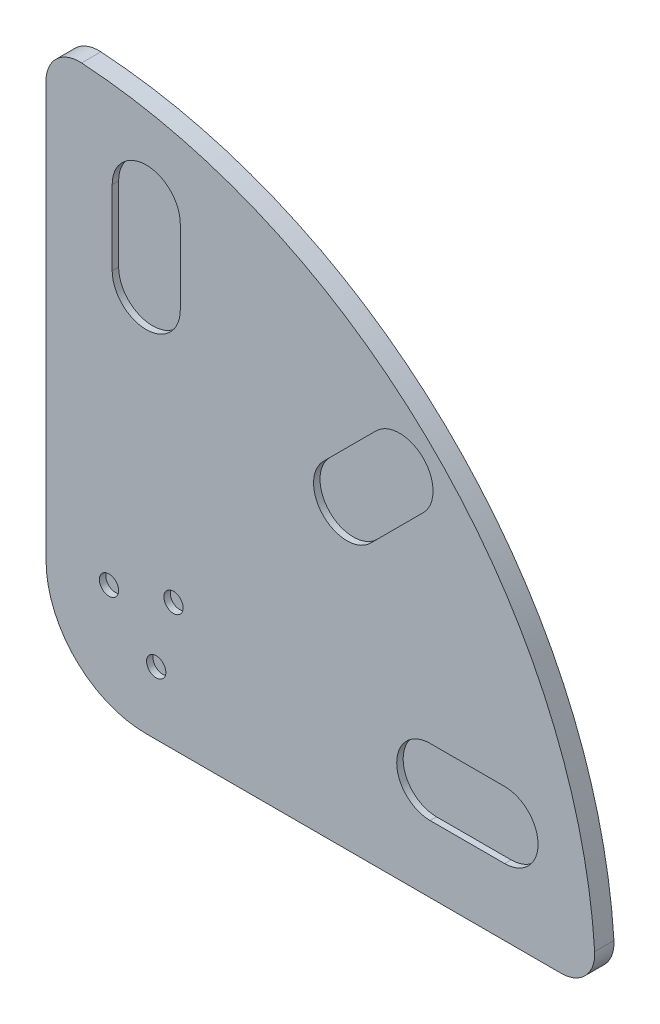
ISO-10303-21;
HEADER;
FILE_DESCRIPTION(('STEP AP214'),'2;1');
FILE_NAME('part.step','',(''),(''),'','','');
FILE_SCHEMA(('AUTOMOTIVE_DESIGN { 1 0 10303 214 1 1 1 1 }'));
ENDSEC;
DATA;
#1=APPLICATION_CONTEXT('core data for automotive mechanical design processes');
#2=APPLICATION_PROTOCOL_DEFINITION('international standard','automotive_design',2000,#1);
#3=PRODUCT_CONTEXT('',#1,'mechanical');
#4=PRODUCT('Part','Part','',(#3));
#5=PRODUCT_RELATED_PRODUCT_CATEGORY('part','',(#4));
#6=PRODUCT_DEFINITION_FORMATION('','',#4);
#7=PRODUCT_DEFINITION_CONTEXT('part definition',#1,'design');
#8=PRODUCT_DEFINITION('design','',#6,#7);
#9=PRODUCT_DEFINITION_SHAPE('','',#8);
#10=(LENGTH_UNIT() NAMED_UNIT(*) SI_UNIT(.MILLI.,.METRE.));
#11=(NAMED_UNIT(*) PLANE_ANGLE_UNIT() SI_UNIT($,.RADIAN.));
#12=(NAMED_UNIT(*) SI_UNIT($,.STERADIAN.) SOLID_ANGLE_UNIT());
#13=UNCERTAINTY_MEASURE_WITH_UNIT(LENGTH_MEASURE(1.E-05),#10,'distance_accuracy_value','');
#14=(GEOMETRIC_REPRESENTATION_CONTEXT(3) GLOBAL_UNCERTAINTY_ASSIGNED_CONTEXT((#13)) GLOBAL_UNIT_ASSIGNED_CONTEXT((#10,
#11,#12)) REPRESENTATION_CONTEXT('',''));
#15=CARTESIAN_POINT('',(0.,0.,0.));
#16=DIRECTION('',(0.,0.,1.));
#17=DIRECTION('',(1.,0.,0.));
#18=AXIS2_PLACEMENT_3D('',#15,#16,#17);
#19=CARTESIAN_POINT('',(0.,0.,15.));
#20=DIRECTION('',(0.,0.,-1.));
#21=DIRECTION('',(-1.,0.,0.));
#22=AXIS2_PLACEMENT_3D('',#19,#20,#21);
#23=CYLINDRICAL_SURFACE('',#22,78.);
#24=CARTESIAN_POINT('',(0.,0.,0.));
#25=DIRECTION('',(0.,0.,1.));
#26=DIRECTION('',(1.,0.,0.));
#27=AXIS2_PLACEMENT_3D('',#24,#25,#26);
#28=CIRCLE('',#27,78.);
#29=CARTESIAN_POINT('',(-78.,0.,0.));
#30=VERTEX_POINT('',#29);
#31=CARTESIAN_POINT('',(0.,-78.,0.));
#32=VERTEX_POINT('',#31);
#33=EDGE_CURVE('E283',#30,#32,#28,.T.);
#34=ORIENTED_EDGE('',*,*,#33,.T.);
#35=DIRECTION('',(0.,0.,-1.));
#36=VECTOR('',#35,1.);
#37=CARTESIAN_POINT('',(0.,-78.,15.));
#38=LINE('',#37,#36);
#39=CARTESIAN_POINT('',(0.,-78.,15.));
#40=VERTEX_POINT('',#39);
#41=EDGE_CURVE('E307',#40,#32,#38,.T.);
#42=ORIENTED_EDGE('',*,*,#41,.F.);
#43=CARTESIAN_POINT('',(0.,0.,15.));
#44=DIRECTION('',(0.,0.,1.));
#45=DIRECTION('',(1.,0.,0.));
#46=AXIS2_PLACEMENT_3D('',#43,#44,#45);
#47=CIRCLE('',#46,78.);
#48=CARTESIAN_POINT('',(-78.,0.,15.));
#49=VERTEX_POINT('',#48);
#50=EDGE_CURVE('E286',#49,#40,#47,.T.);
#51=ORIENTED_EDGE('',*,*,#50,.F.);
#52=DIRECTION('',(0.,0.,-1.));
#53=VECTOR('',#52,1.);
#54=CARTESIAN_POINT('',(-78.,0.,15.));
#55=LINE('',#54,#53);
#56=EDGE_CURVE('E296',#49,#30,#55,.T.);
#57=ORIENTED_EDGE('',*,*,#56,.T.);
#58=EDGE_LOOP('',(#34,#42,#51,#57));
#59=FACE_BOUND('',#58,.T.);
#60=ADVANCED_FACE('F34',(#59),#23,.T.);
#61=CARTESIAN_POINT('',(0.,-78.,15.));
#62=DIRECTION('',(0.,1.,0.));
#63=DIRECTION('',(0.,0.,1.));
#64=AXIS2_PLACEMENT_3D('',#61,#62,#63);
#65=PLANE('',#64);
#66=DIRECTION('',(1.,0.,0.));
#67=VECTOR('',#66,1.);
#68=CARTESIAN_POINT('',(0.,-78.,0.));
#69=LINE('',#68,#67);
#70=CARTESIAN_POINT('',(323.158322860189,-78.,0.));
#71=VERTEX_POINT('',#70);
#72=EDGE_CURVE('E299',#32,#71,#69,.T.);
#73=ORIENTED_EDGE('',*,*,#72,.T.);
#74=DIRECTION('',(0.,0.,-1.));
#75=VECTOR('',#74,1.);
#76=CARTESIAN_POINT('',(323.158322860189,-78.,15.));
#77=LINE('',#76,#75);
#78=CARTESIAN_POINT('',(323.158322860189,-78.,15.));
#79=VERTEX_POINT('',#78);
#80=EDGE_CURVE('E57',#71,#79,#77,.F.);
#81=ORIENTED_EDGE('',*,*,#80,.T.);
#82=DIRECTION('',(1.,0.,0.));
#83=VECTOR('',#82,1.);
#84=CARTESIAN_POINT('',(0.,-78.,15.));
#85=LINE('',#84,#83);
#86=EDGE_CURVE('E289',#40,#79,#85,.T.);
#87=ORIENTED_EDGE('',*,*,#86,.F.);
#88=ORIENTED_EDGE('',*,*,#41,.T.);
#89=EDGE_LOOP('',(#73,#81,#87,#88));
#90=FACE_BOUND('',#89,.T.);
#91=ADVANCED_FACE('F333',(#90),#65,.F.);
#92=CARTESIAN_POINT('',(-78.,-78.,15.));
#93=DIRECTION('',(0.,0.,-1.));
#94=DIRECTION('',(-1.,0.,0.));
#95=AXIS2_PLACEMENT_3D('',#92,#93,#94);
#96=CYLINDRICAL_SURFACE('',#95,428.);
#97=CARTESIAN_POINT('',(-78.,-78.,15.));
#98=DIRECTION('',(0.,0.,1.));
#99=DIRECTION('',(-1.,0.,0.));
#100=AXIS2_PLACEMENT_3D('',#97,#98,#99);
#101=CIRCLE('',#100,428.);
#102=CARTESIAN_POINT('',(349.103886030251,-50.318407960199,15.));
#103=VERTEX_POINT('',#102);
#104=CARTESIAN_POINT('',(-50.318407960199,349.103886030251,15.));
#105=VERTEX_POINT('',#104);
#106=EDGE_CURVE('E292',#103,#105,#101,.T.);
#107=ORIENTED_EDGE('',*,*,#106,.F.);
#108=DIRECTION('',(0.,0.,-1.));
#109=VECTOR('',#108,1.);
#110=CARTESIAN_POINT('',(349.103886030251,-50.318407960199,15.));
#111=LINE('',#110,#109);
#112=CARTESIAN_POINT('',(349.103886030251,-50.318407960199,0.));
#113=VERTEX_POINT('',#112);
#114=EDGE_CURVE('E312',#103,#113,#111,.T.);
#115=ORIENTED_EDGE('',*,*,#114,.T.);
#116=CARTESIAN_POINT('',(-78.,-78.,0.));
#117=DIRECTION('',(0.,0.,1.));
#118=DIRECTION('',(-1.,0.,0.));
#119=AXIS2_PLACEMENT_3D('',#116,#117,#118);
#120=CIRCLE('',#119,428.);
#121=CARTESIAN_POINT('',(-50.318407960199,349.103886030251,0.));
#122=VERTEX_POINT('',#121);
#123=EDGE_CURVE('E301',#113,#122,#120,.T.);
#124=ORIENTED_EDGE('',*,*,#123,.T.);
#125=DIRECTION('',(0.,0.,-1.));
#126=VECTOR('',#125,1.);
#127=CARTESIAN_POINT('',(-50.318407960199,349.103886030251,15.));
#128=LINE('',#127,#126);
#129=EDGE_CURVE('E310',#122,#105,#128,.F.);
#130=ORIENTED_EDGE('',*,*,#129,.T.);
#131=EDGE_LOOP('',(#107,#115,#124,#130));
#132=FACE_BOUND('',#131,.T.);
#133=ADVANCED_FACE('F326',(#132),#96,.T.);
#134=CARTESIAN_POINT('',(-78.,0.,15.));
#135=DIRECTION('',(1.,0.,0.));
#136=DIRECTION('',(0.,0.,-1.));
#137=AXIS2_PLACEMENT_3D('',#134,#135,#136);
#138=PLANE('',#137);
#139=DIRECTION('',(0.,-1.,0.));
#140=VECTOR('',#139,1.);
#141=CARTESIAN_POINT('',(-78.,0.,15.));
#142=LINE('',#141,#140);
#143=CARTESIAN_POINT('',(-78.,323.158322860189,15.));
#144=VERTEX_POINT('',#143);
#145=EDGE_CURVE('E294',#144,#49,#142,.T.);
#146=ORIENTED_EDGE('',*,*,#145,.F.);
#147=DIRECTION('',(0.,0.,-1.));
#148=VECTOR('',#147,1.);
#149=CARTESIAN_POINT('',(-78.,323.158322860189,15.));
#150=LINE('',#149,#148);
#151=CARTESIAN_POINT('',(-78.,323.158322860189,0.));
#152=VERTEX_POINT('',#151);
#153=EDGE_CURVE('E11',#144,#152,#150,.T.);
#154=ORIENTED_EDGE('',*,*,#153,.T.);
#155=DIRECTION('',(0.,-1.,0.));
#156=VECTOR('',#155,1.);
#157=CARTESIAN_POINT('',(-78.,0.,0.));
#158=LINE('',#157,#156);
#159=EDGE_CURVE('E290',#152,#30,#158,.T.);
#160=ORIENTED_EDGE('',*,*,#159,.T.);
#161=ORIENTED_EDGE('',*,*,#56,.F.);
#162=EDGE_LOOP('',(#146,#154,#160,#161));
#163=FACE_BOUND('',#162,.T.);
#164=ADVANCED_FACE('F340',(#163),#138,.F.);
#165=CARTESIAN_POINT('',(0.,0.,15.));
#166=DIRECTION('',(0.,0.,1.));
#167=DIRECTION('',(1.,0.,0.));
#168=AXIS2_PLACEMENT_3D('',#165,#166,#167);
#169=PLANE('',#168);
#170=CARTESIAN_POINT('',(7.76457135307558,-28.9777747886721,15.));
#171=DIRECTION('',(0.,0.,1.));
#172=DIRECTION('',(1.,0.,0.));
#173=AXIS2_PLACEMENT_3D('',#170,#171,#172);
#174=CIRCLE('',#173,7.49999999999999);
#175=CARTESIAN_POINT('',(15.2645713530756,-28.9777747886721,15.));
#176=VERTEX_POINT('',#175);
#177=EDGE_CURVE('E208',#176,#176,#174,.T.);
#178=ORIENTED_EDGE('',*,*,#177,.F.);
#179=EDGE_LOOP('',(#178));
#180=FACE_BOUND('',#179,.T.);
#181=CARTESIAN_POINT('',(-28.977774788672,7.76457135307565,15.));
#182=DIRECTION('',(0.,0.,1.));
#183=DIRECTION('',(1.,0.,0.));
#184=AXIS2_PLACEMENT_3D('',#181,#182,#183);
#185=CIRCLE('',#184,7.5);
#186=CARTESIAN_POINT('',(-21.477774788672,7.76457135307565,15.));
#187=VERTEX_POINT('',#186);
#188=EDGE_CURVE('E214',#187,#187,#185,.T.);
#189=ORIENTED_EDGE('',*,*,#188,.F.);
#190=EDGE_LOOP('',(#189));
#191=FACE_BOUND('',#190,.T.);
#192=CARTESIAN_POINT('',(0.,279.,15.));
#193=DIRECTION('',(0.,0.,1.));
#194=DIRECTION('',(1.,0.,0.));
#195=AXIS2_PLACEMENT_3D('',#192,#193,#194);
#196=CIRCLE('',#195,26.5);
#197=CARTESIAN_POINT('',(26.5,279.,15.));
#198=VERTEX_POINT('',#197);
#199=CARTESIAN_POINT('',(-26.5,279.,15.));
#200=VERTEX_POINT('',#199);
#201=EDGE_CURVE('E232',#198,#200,#196,.T.);
#202=ORIENTED_EDGE('',*,*,#201,.F.);
#203=DIRECTION('',(0.,1.,0.));
#204=VECTOR('',#203,1.);
#205=CARTESIAN_POINT('',(26.5,279.,15.));
#206=LINE('',#205,#204);
#207=CARTESIAN_POINT('',(26.5,221.,15.));
#208=VERTEX_POINT('',#207);
#209=EDGE_CURVE('E222',#208,#198,#206,.T.);
#210=ORIENTED_EDGE('',*,*,#209,.F.);
#211=CARTESIAN_POINT('',(0.,221.,15.));
#212=DIRECTION('',(0.,0.,1.));
#213=DIRECTION('',(1.,0.,0.));
#214=AXIS2_PLACEMENT_3D('',#211,#212,#213);
#215=CIRCLE('',#214,26.5);
#216=CARTESIAN_POINT('',(-26.5,221.,15.));
#217=VERTEX_POINT('',#216);
#218=EDGE_CURVE('E238',#217,#208,#215,.T.);
#219=ORIENTED_EDGE('',*,*,#218,.F.);
#220=DIRECTION('',(0.,-1.,0.));
#221=VECTOR('',#220,1.);
#222=CARTESIAN_POINT('',(-26.5,279.,15.));
#223=LINE('',#222,#221);
#224=EDGE_CURVE('E234',#200,#217,#223,.T.);
#225=ORIENTED_EDGE('',*,*,#224,.F.);
#226=EDGE_LOOP('',(#202,#210,#219,#225));
#227=FACE_BOUND('',#226,.T.);
#228=CARTESIAN_POINT('',(197.282791951047,197.282791951046,15.));
#229=DIRECTION('',(0.,0.,1.));
#230=DIRECTION('',(1.,0.,0.));
#231=AXIS2_PLACEMENT_3D('',#228,#229,#230);
#232=CIRCLE('',#231,26.);
#233=CARTESIAN_POINT('',(215.667568261897,178.898015640196,15.));
#234=VERTEX_POINT('',#233);
#235=CARTESIAN_POINT('',(178.898015640197,215.667568261897,15.));
#236=VERTEX_POINT('',#235);
#237=EDGE_CURVE('E200',#234,#236,#232,.T.);
#238=ORIENTED_EDGE('',*,*,#237,.F.);
#239=DIRECTION('',(0.707106781186547,0.707106781186548,0.));
#240=VECTOR('',#239,1.);
#241=CARTESIAN_POINT('',(215.667568261897,178.898015640196,15.));
#242=LINE('',#241,#240);
#243=CARTESIAN_POINT('',(174.655374953078,137.885822331376,15.));
#244=VERTEX_POINT('',#243);
#245=EDGE_CURVE('E254',#244,#234,#242,.T.);
#246=ORIENTED_EDGE('',*,*,#245,.F.);
#247=CARTESIAN_POINT('',(156.270598642227,156.270598642227,15.));
#248=DIRECTION('',(0.,0.,1.));
#249=DIRECTION('',(1.,0.,0.));
#250=AXIS2_PLACEMENT_3D('',#247,#248,#249);
#251=CIRCLE('',#250,26.0000000000001);
#252=CARTESIAN_POINT('',(137.885822331377,174.655374953077,15.));
#253=VERTEX_POINT('',#252);
#254=EDGE_CURVE('E268',#253,#244,#251,.T.);
#255=ORIENTED_EDGE('',*,*,#254,.F.);
#256=DIRECTION('',(-0.707106781186548,-0.707106781186547,0.));
#257=VECTOR('',#256,1.);
#258=CARTESIAN_POINT('',(178.898015640197,215.667568261897,15.));
#259=LINE('',#258,#257);
#260=EDGE_CURVE('E265',#236,#253,#259,.T.);
#261=ORIENTED_EDGE('',*,*,#260,.F.);
#262=EDGE_LOOP('',(#238,#246,#255,#261));
#263=FACE_BOUND('',#262,.T.);
#264=CARTESIAN_POINT('',(221.,0.,15.));
#265=DIRECTION('',(0.,0.,1.));
#266=DIRECTION('',(1.,0.,0.));
#267=AXIS2_PLACEMENT_3D('',#264,#265,#266);
#268=CIRCLE('',#267,26.);
#269=CARTESIAN_POINT('',(221.,26.,15.));
#270=VERTEX_POINT('',#269);
#271=CARTESIAN_POINT('',(221.,-26.,15.));
#272=VERTEX_POINT('',#271);
#273=EDGE_CURVE('E168',#270,#272,#268,.T.);
#274=ORIENTED_EDGE('',*,*,#273,.F.);
#275=DIRECTION('',(-1.,0.,0.));
#276=VECTOR('',#275,1.);
#277=CARTESIAN_POINT('',(221.,26.,15.));
#278=LINE('',#277,#276);
#279=CARTESIAN_POINT('',(279.,26.,15.));
#280=VERTEX_POINT('',#279);
#281=EDGE_CURVE('E185',#280,#270,#278,.T.);
#282=ORIENTED_EDGE('',*,*,#281,.F.);
#283=CARTESIAN_POINT('',(279.,0.,15.));
#284=DIRECTION('',(0.,0.,1.));
#285=DIRECTION('',(1.,0.,0.));
#286=AXIS2_PLACEMENT_3D('',#283,#284,#285);
#287=CIRCLE('',#286,26.);
#288=CARTESIAN_POINT('',(279.,-26.,15.));
#289=VERTEX_POINT('',#288);
#290=EDGE_CURVE('E188',#289,#280,#287,.T.);
#291=ORIENTED_EDGE('',*,*,#290,.F.);
#292=DIRECTION('',(1.,0.,0.));
#293=VECTOR('',#292,1.);
#294=CARTESIAN_POINT('',(221.,-26.,15.));
#295=LINE('',#294,#293);
#296=EDGE_CURVE('E194',#272,#289,#295,.T.);
#297=ORIENTED_EDGE('',*,*,#296,.F.);
#298=EDGE_LOOP('',(#274,#282,#291,#297));
#299=FACE_BOUND('',#298,.T.);
#300=CARTESIAN_POINT('',(21.2132034355965,21.2132034355964,15.));
#301=DIRECTION('',(0.,0.,1.));
#302=DIRECTION('',(1.,0.,0.));
#303=AXIS2_PLACEMENT_3D('',#300,#301,#302);
#304=CIRCLE('',#303,7.49999999999998);
#305=CARTESIAN_POINT('',(28.7132034355964,21.2132034355964,15.));
#306=VERTEX_POINT('',#305);
#307=EDGE_CURVE('E207',#306,#306,#304,.T.);
#308=ORIENTED_EDGE('',*,*,#307,.F.);
#309=EDGE_LOOP('',(#308));
#310=FACE_BOUND('',#309,.T.);
#311=ORIENTED_EDGE('',*,*,#86,.T.);
#312=CARTESIAN_POINT('',(323.158322860189,-52.,15.));
#313=DIRECTION('',(0.,0.,1.));
#314=DIRECTION('',(1.,0.,0.));
#315=AXIS2_PLACEMENT_3D('',#312,#313,#314);
#316=CIRCLE('',#315,26.);
#317=EDGE_CURVE('E42',#79,#103,#316,.T.);
#318=ORIENTED_EDGE('',*,*,#317,.T.);
#319=ORIENTED_EDGE('',*,*,#106,.T.);
#320=CARTESIAN_POINT('',(-52.,323.158322860189,15.));
#321=DIRECTION('',(0.,0.,1.));
#322=DIRECTION('',(1.,0.,0.));
#323=AXIS2_PLACEMENT_3D('',#320,#321,#322);
#324=CIRCLE('',#323,26.);
#325=EDGE_CURVE('E49',#105,#144,#324,.T.);
#326=ORIENTED_EDGE('',*,*,#325,.T.);
#327=ORIENTED_EDGE('',*,*,#145,.T.);
#328=ORIENTED_EDGE('',*,*,#50,.T.);
#329=EDGE_LOOP('',(#311,#318,#319,#326,#327,#328));
#330=FACE_BOUND('',#329,.T.);
#331=ADVANCED_FACE('F322',(#180,#191,#227,#263,#299,#310,#330),#169,.T.);
#332=CARTESIAN_POINT('',(0.,0.,0.));
#333=DIRECTION('',(0.,0.,1.));
#334=DIRECTION('',(1.,0.,0.));
#335=AXIS2_PLACEMENT_3D('',#332,#333,#334);
#336=PLANE('',#335);
#337=ORIENTED_EDGE('',*,*,#123,.F.);
#338=CARTESIAN_POINT('',(323.158322860189,-52.,0.));
#339=DIRECTION('',(0.,0.,1.));
#340=DIRECTION('',(1.,0.,0.));
#341=AXIS2_PLACEMENT_3D('',#338,#339,#340);
#342=CIRCLE('',#341,26.);
#343=EDGE_CURVE('E317',#113,#71,#342,.F.);
#344=ORIENTED_EDGE('',*,*,#343,.T.);
#345=ORIENTED_EDGE('',*,*,#72,.F.);
#346=ORIENTED_EDGE('',*,*,#33,.F.);
#347=ORIENTED_EDGE('',*,*,#159,.F.);
#348=CARTESIAN_POINT('',(-52.,323.158322860189,0.));
#349=DIRECTION('',(0.,0.,1.));
#350=DIRECTION('',(1.,0.,0.));
#351=AXIS2_PLACEMENT_3D('',#348,#349,#350);
#352=CIRCLE('',#351,26.);
#353=EDGE_CURVE('E315',#152,#122,#352,.F.);
#354=ORIENTED_EDGE('',*,*,#353,.T.);
#355=EDGE_LOOP('',(#337,#344,#345,#346,#347,#354));
#356=FACE_BOUND('',#355,.T.);
#357=ADVANCED_FACE('F331',(#356),#336,.F.);
#358=CARTESIAN_POINT('',(21.2132034355965,21.2132034355964,10.));
#359=DIRECTION('',(0.,0.,1.));
#360=DIRECTION('',(1.,0.,0.));
#361=AXIS2_PLACEMENT_3D('',#358,#359,#360);
#362=CYLINDRICAL_SURFACE('',#361,7.49999999999998);
#363=CARTESIAN_POINT('',(21.2132034355965,21.2132034355964,10.));
#364=DIRECTION('',(0.,0.,1.));
#365=DIRECTION('',(1.,0.,0.));
#366=AXIS2_PLACEMENT_3D('',#363,#364,#365);
#367=CIRCLE('',#366,7.49999999999998);
#368=CARTESIAN_POINT('',(28.7132034355964,21.2132034355964,10.));
#369=VERTEX_POINT('',#368);
#370=EDGE_CURVE('E280',#369,#369,#367,.T.);
#371=ORIENTED_EDGE('',*,*,#370,.F.);
#372=EDGE_LOOP('',(#371));
#373=FACE_BOUND('',#372,.T.);
#374=ORIENTED_EDGE('',*,*,#307,.T.);
#375=EDGE_LOOP('',(#374));
#376=FACE_BOUND('',#375,.T.);
#377=ADVANCED_FACE('F361',(#373,#376),#362,.F.);
#378=CARTESIAN_POINT('',(21.2132034355965,21.2132034355964,10.));
#379=DIRECTION('',(0.,0.,1.));
#380=DIRECTION('',(1.,0.,0.));
#381=AXIS2_PLACEMENT_3D('',#378,#379,#380);
#382=PLANE('',#381);
#383=ORIENTED_EDGE('',*,*,#370,.T.);
#384=EDGE_LOOP('',(#383));
#385=FACE_BOUND('',#384,.T.);
#386=ADVANCED_FACE('F367',(#385),#382,.T.);
#387=CARTESIAN_POINT('',(221.,0.,10.));
#388=DIRECTION('',(0.,0.,1.));
#389=DIRECTION('',(1.,0.,0.));
#390=AXIS2_PLACEMENT_3D('',#387,#388,#389);
#391=CYLINDRICAL_SURFACE('',#390,26.);
#392=ORIENTED_EDGE('',*,*,#273,.T.);
#393=DIRECTION('',(0.,0.,1.));
#394=VECTOR('',#393,1.);
#395=CARTESIAN_POINT('',(221.,-26.,10.));
#396=LINE('',#395,#394);
#397=CARTESIAN_POINT('',(221.,-26.,10.));
#398=VERTEX_POINT('',#397);
#399=EDGE_CURVE('E161',#398,#272,#396,.T.);
#400=ORIENTED_EDGE('',*,*,#399,.F.);
#401=CARTESIAN_POINT('',(221.,0.,10.));
#402=DIRECTION('',(0.,0.,1.));
#403=DIRECTION('',(1.,0.,0.));
#404=AXIS2_PLACEMENT_3D('',#401,#402,#403);
#405=CIRCLE('',#404,26.);
#406=CARTESIAN_POINT('',(221.,26.,10.));
#407=VERTEX_POINT('',#406);
#408=EDGE_CURVE('E165',#407,#398,#405,.T.);
#409=ORIENTED_EDGE('',*,*,#408,.F.);
#410=DIRECTION('',(0.,0.,1.));
#411=VECTOR('',#410,1.);
#412=CARTESIAN_POINT('',(221.,26.,10.));
#413=LINE('',#412,#411);
#414=EDGE_CURVE('E198',#407,#270,#413,.T.);
#415=ORIENTED_EDGE('',*,*,#414,.T.);
#416=EDGE_LOOP('',(#392,#400,#409,#415));
#417=FACE_BOUND('',#416,.T.);
#418=ADVANCED_FACE('F163',(#417),#391,.F.);
#419=CARTESIAN_POINT('',(221.,26.,10.));
#420=DIRECTION('',(0.,1.,0.));
#421=DIRECTION('',(-1.,0.,0.));
#422=AXIS2_PLACEMENT_3D('',#419,#420,#421);
#423=PLANE('',#422);
#424=ORIENTED_EDGE('',*,*,#281,.T.);
#425=ORIENTED_EDGE('',*,*,#414,.F.);
#426=DIRECTION('',(-1.,0.,0.));
#427=VECTOR('',#426,1.);
#428=CARTESIAN_POINT('',(221.,26.,10.));
#429=LINE('',#428,#427);
#430=CARTESIAN_POINT('',(279.,26.,10.));
#431=VERTEX_POINT('',#430);
#432=EDGE_CURVE('E173',#431,#407,#429,.T.);
#433=ORIENTED_EDGE('',*,*,#432,.F.);
#434=DIRECTION('',(0.,0.,1.));
#435=VECTOR('',#434,1.);
#436=CARTESIAN_POINT('',(279.,26.,10.));
#437=LINE('',#436,#435);
#438=EDGE_CURVE('E201',#431,#280,#437,.T.);
#439=ORIENTED_EDGE('',*,*,#438,.T.);
#440=EDGE_LOOP('',(#424,#425,#433,#439));
#441=FACE_BOUND('',#440,.T.);
#442=ADVANCED_FACE('F429',(#441),#423,.F.);
#443=CARTESIAN_POINT('',(279.,0.,10.));
#444=DIRECTION('',(0.,0.,1.));
#445=DIRECTION('',(1.,0.,0.));
#446=AXIS2_PLACEMENT_3D('',#443,#444,#445);
#447=CYLINDRICAL_SURFACE('',#446,26.);
#448=ORIENTED_EDGE('',*,*,#290,.T.);
#449=ORIENTED_EDGE('',*,*,#438,.F.);
#450=CARTESIAN_POINT('',(279.,0.,10.));
#451=DIRECTION('',(0.,0.,1.));
#452=DIRECTION('',(1.,0.,0.));
#453=AXIS2_PLACEMENT_3D('',#450,#451,#452);
#454=CIRCLE('',#453,26.);
#455=CARTESIAN_POINT('',(279.,-26.,10.));
#456=VERTEX_POINT('',#455);
#457=EDGE_CURVE('E181',#456,#431,#454,.T.);
#458=ORIENTED_EDGE('',*,*,#457,.F.);
#459=DIRECTION('',(0.,0.,1.));
#460=VECTOR('',#459,1.);
#461=CARTESIAN_POINT('',(279.,-26.,10.));
#462=LINE('',#461,#460);
#463=EDGE_CURVE('E172',#456,#289,#462,.T.);
#464=ORIENTED_EDGE('',*,*,#463,.T.);
#465=EDGE_LOOP('',(#448,#449,#458,#464));
#466=FACE_BOUND('',#465,.T.);
#467=ADVANCED_FACE('F432',(#466),#447,.F.);
#468=CARTESIAN_POINT('',(221.,-26.,10.));
#469=DIRECTION('',(0.,-1.,0.));
#470=DIRECTION('',(1.,0.,0.));
#471=AXIS2_PLACEMENT_3D('',#468,#469,#470);
#472=PLANE('',#471);
#473=ORIENTED_EDGE('',*,*,#296,.T.);
#474=ORIENTED_EDGE('',*,*,#463,.F.);
#475=DIRECTION('',(1.,0.,0.));
#476=VECTOR('',#475,1.);
#477=CARTESIAN_POINT('',(221.,-26.,10.));
#478=LINE('',#477,#476);
#479=EDGE_CURVE('E176',#398,#456,#478,.T.);
#480=ORIENTED_EDGE('',*,*,#479,.F.);
#481=ORIENTED_EDGE('',*,*,#399,.T.);
#482=EDGE_LOOP('',(#473,#474,#480,#481));
#483=FACE_BOUND('',#482,.T.);
#484=ADVANCED_FACE('F177',(#483),#472,.F.);
#485=CARTESIAN_POINT('',(221.,0.,10.));
#486=DIRECTION('',(0.,0.,1.));
#487=DIRECTION('',(1.,0.,0.));
#488=AXIS2_PLACEMENT_3D('',#485,#486,#487);
#489=PLANE('',#488);
#490=ORIENTED_EDGE('',*,*,#408,.T.);
#491=ORIENTED_EDGE('',*,*,#479,.T.);
#492=ORIENTED_EDGE('',*,*,#457,.T.);
#493=ORIENTED_EDGE('',*,*,#432,.T.);
#494=EDGE_LOOP('',(#490,#491,#492,#493));
#495=FACE_BOUND('',#494,.T.);
#496=ADVANCED_FACE('F183',(#495),#489,.T.);
#497=CARTESIAN_POINT('',(197.282791951047,197.282791951046,10.));
#498=DIRECTION('',(0.,0.,1.));
#499=DIRECTION('',(1.,0.,0.));
#500=AXIS2_PLACEMENT_3D('',#497,#498,#499);
#501=CYLINDRICAL_SURFACE('',#500,26.);
#502=ORIENTED_EDGE('',*,*,#237,.T.);
#503=DIRECTION('',(0.,0.,1.));
#504=VECTOR('',#503,1.);
#505=CARTESIAN_POINT('',(178.898015640197,215.667568261897,10.));
#506=LINE('',#505,#504);
#507=CARTESIAN_POINT('',(178.898015640197,215.667568261897,10.));
#508=VERTEX_POINT('',#507);
#509=EDGE_CURVE('E263',#508,#236,#506,.T.);
#510=ORIENTED_EDGE('',*,*,#509,.F.);
#511=CARTESIAN_POINT('',(197.282791951047,197.282791951046,10.));
#512=DIRECTION('',(0.,0.,1.));
#513=DIRECTION('',(1.,0.,0.));
#514=AXIS2_PLACEMENT_3D('',#511,#512,#513);
#515=CIRCLE('',#514,26.);
#516=CARTESIAN_POINT('',(215.667568261897,178.898015640196,10.));
#517=VERTEX_POINT('',#516);
#518=EDGE_CURVE('E250',#517,#508,#515,.T.);
#519=ORIENTED_EDGE('',*,*,#518,.F.);
#520=DIRECTION('',(0.,0.,1.));
#521=VECTOR('',#520,1.);
#522=CARTESIAN_POINT('',(215.667568261897,178.898015640196,10.));
#523=LINE('',#522,#521);
#524=EDGE_CURVE('E235',#517,#234,#523,.T.);
#525=ORIENTED_EDGE('',*,*,#524,.T.);
#526=EDGE_LOOP('',(#502,#510,#519,#525));
#527=FACE_BOUND('',#526,.T.);
#528=ADVANCED_FACE('F372',(#527),#501,.F.);
#529=CARTESIAN_POINT('',(215.667568261897,178.898015640196,10.));
#530=DIRECTION('',(0.707106781186548,-0.707106781186547,0.));
#531=DIRECTION('',(0.707106781186547,0.707106781186548,0.));
#532=AXIS2_PLACEMENT_3D('',#529,#530,#531);
#533=PLANE('',#532);
#534=ORIENTED_EDGE('',*,*,#245,.T.);
#535=ORIENTED_EDGE('',*,*,#524,.F.);
#536=DIRECTION('',(0.707106781186547,0.707106781186548,0.));
#537=VECTOR('',#536,1.);
#538=CARTESIAN_POINT('',(215.667568261897,178.898015640196,10.));
#539=LINE('',#538,#537);
#540=CARTESIAN_POINT('',(174.655374953078,137.885822331376,10.));
#541=VERTEX_POINT('',#540);
#542=EDGE_CURVE('E260',#541,#517,#539,.T.);
#543=ORIENTED_EDGE('',*,*,#542,.F.);
#544=DIRECTION('',(0.,0.,1.));
#545=VECTOR('',#544,1.);
#546=CARTESIAN_POINT('',(174.655374953078,137.885822331376,10.));
#547=LINE('',#546,#545);
#548=EDGE_CURVE('E274',#541,#244,#547,.T.);
#549=ORIENTED_EDGE('',*,*,#548,.T.);
#550=EDGE_LOOP('',(#534,#535,#543,#549));
#551=FACE_BOUND('',#550,.T.);
#552=ADVANCED_FACE('F375',(#551),#533,.F.);
#553=CARTESIAN_POINT('',(156.270598642227,156.270598642227,10.));
#554=DIRECTION('',(0.,0.,1.));
#555=DIRECTION('',(1.,0.,0.));
#556=AXIS2_PLACEMENT_3D('',#553,#554,#555);
#557=CYLINDRICAL_SURFACE('',#556,26.0000000000001);
#558=ORIENTED_EDGE('',*,*,#254,.T.);
#559=ORIENTED_EDGE('',*,*,#548,.F.);
#560=CARTESIAN_POINT('',(156.270598642227,156.270598642227,10.));
#561=DIRECTION('',(0.,0.,1.));
#562=DIRECTION('',(1.,0.,0.));
#563=AXIS2_PLACEMENT_3D('',#560,#561,#562);
#564=CIRCLE('',#563,26.0000000000001);
#565=CARTESIAN_POINT('',(137.885822331377,174.655374953077,10.));
#566=VERTEX_POINT('',#565);
#567=EDGE_CURVE('E257',#566,#541,#564,.T.);
#568=ORIENTED_EDGE('',*,*,#567,.F.);
#569=DIRECTION('',(0.,0.,1.));
#570=VECTOR('',#569,1.);
#571=CARTESIAN_POINT('',(137.885822331377,174.655374953077,10.));
#572=LINE('',#571,#570);
#573=EDGE_CURVE('E276',#566,#253,#572,.T.);
#574=ORIENTED_EDGE('',*,*,#573,.T.);
#575=EDGE_LOOP('',(#558,#559,#568,#574));
#576=FACE_BOUND('',#575,.T.);
#577=ADVANCED_FACE('F381',(#576),#557,.F.);
#578=CARTESIAN_POINT('',(178.898015640197,215.667568261897,10.));
#579=DIRECTION('',(-0.707106781186547,0.707106781186548,0.));
#580=DIRECTION('',(-0.707106781186548,-0.707106781186547,0.));
#581=AXIS2_PLACEMENT_3D('',#578,#579,#580);
#582=PLANE('',#581);
#583=ORIENTED_EDGE('',*,*,#260,.T.);
#584=ORIENTED_EDGE('',*,*,#573,.F.);
#585=DIRECTION('',(-0.707106781186548,-0.707106781186547,0.));
#586=VECTOR('',#585,1.);
#587=CARTESIAN_POINT('',(178.898015640197,215.667568261897,10.));
#588=LINE('',#587,#586);
#589=EDGE_CURVE('E253',#508,#566,#588,.T.);
#590=ORIENTED_EDGE('',*,*,#589,.F.);
#591=ORIENTED_EDGE('',*,*,#509,.T.);
#592=EDGE_LOOP('',(#583,#584,#590,#591));
#593=FACE_BOUND('',#592,.T.);
#594=ADVANCED_FACE('F377',(#593),#582,.F.);
#595=CARTESIAN_POINT('',(197.282791951047,197.282791951046,10.));
#596=DIRECTION('',(0.,0.,1.));
#597=DIRECTION('',(1.,0.,0.));
#598=AXIS2_PLACEMENT_3D('',#595,#596,#597);
#599=PLANE('',#598);
#600=ORIENTED_EDGE('',*,*,#518,.T.);
#601=ORIENTED_EDGE('',*,*,#589,.T.);
#602=ORIENTED_EDGE('',*,*,#567,.T.);
#603=ORIENTED_EDGE('',*,*,#542,.T.);
#604=EDGE_LOOP('',(#600,#601,#602,#603));
#605=FACE_BOUND('',#604,.T.);
#606=ADVANCED_FACE('F380',(#605),#599,.T.);
#607=CARTESIAN_POINT('',(0.,279.,10.));
#608=DIRECTION('',(0.,0.,1.));
#609=DIRECTION('',(1.,0.,0.));
#610=AXIS2_PLACEMENT_3D('',#607,#608,#609);
#611=CYLINDRICAL_SURFACE('',#610,26.5);
#612=ORIENTED_EDGE('',*,*,#201,.T.);
#613=DIRECTION('',(0.,0.,1.));
#614=VECTOR('',#613,1.);
#615=CARTESIAN_POINT('',(-26.5,279.,10.));
#616=LINE('',#615,#614);
#617=CARTESIAN_POINT('',(-26.5,279.,10.));
#618=VERTEX_POINT('',#617);
#619=EDGE_CURVE('E231',#618,#200,#616,.T.);
#620=ORIENTED_EDGE('',*,*,#619,.F.);
#621=CARTESIAN_POINT('',(0.,279.,10.));
#622=DIRECTION('',(0.,0.,1.));
#623=DIRECTION('',(1.,0.,0.));
#624=AXIS2_PLACEMENT_3D('',#621,#622,#623);
#625=CIRCLE('',#624,26.5);
#626=CARTESIAN_POINT('',(26.5,279.,10.));
#627=VERTEX_POINT('',#626);
#628=EDGE_CURVE('E218',#627,#618,#625,.T.);
#629=ORIENTED_EDGE('',*,*,#628,.F.);
#630=DIRECTION('',(0.,0.,1.));
#631=VECTOR('',#630,1.);
#632=CARTESIAN_POINT('',(26.5,279.,10.));
#633=LINE('',#632,#631);
#634=EDGE_CURVE('E217',#627,#198,#633,.T.);
#635=ORIENTED_EDGE('',*,*,#634,.T.);
#636=EDGE_LOOP('',(#612,#620,#629,#635));
#637=FACE_BOUND('',#636,.T.);
#638=ADVANCED_FACE('F391',(#637),#611,.F.);
#639=CARTESIAN_POINT('',(26.5,279.,10.));
#640=DIRECTION('',(1.,0.,0.));
#641=DIRECTION('',(0.,1.,0.));
#642=AXIS2_PLACEMENT_3D('',#639,#640,#641);
#643=PLANE('',#642);
#644=ORIENTED_EDGE('',*,*,#209,.T.);
#645=ORIENTED_EDGE('',*,*,#634,.F.);
#646=DIRECTION('',(0.,1.,0.));
#647=VECTOR('',#646,1.);
#648=CARTESIAN_POINT('',(26.5,279.,10.));
#649=LINE('',#648,#647);
#650=CARTESIAN_POINT('',(26.5,221.,10.));
#651=VERTEX_POINT('',#650);
#652=EDGE_CURVE('E228',#651,#627,#649,.T.);
#653=ORIENTED_EDGE('',*,*,#652,.F.);
#654=DIRECTION('',(0.,0.,1.));
#655=VECTOR('',#654,1.);
#656=CARTESIAN_POINT('',(26.5,221.,10.));
#657=LINE('',#656,#655);
#658=EDGE_CURVE('E244',#651,#208,#657,.T.);
#659=ORIENTED_EDGE('',*,*,#658,.T.);
#660=EDGE_LOOP('',(#644,#645,#653,#659));
#661=FACE_BOUND('',#660,.T.);
#662=ADVANCED_FACE('F395',(#661),#643,.F.);
#663=CARTESIAN_POINT('',(0.,221.,10.));
#664=DIRECTION('',(0.,0.,1.));
#665=DIRECTION('',(1.,0.,0.));
#666=AXIS2_PLACEMENT_3D('',#663,#664,#665);
#667=CYLINDRICAL_SURFACE('',#666,26.5);
#668=ORIENTED_EDGE('',*,*,#218,.T.);
#669=ORIENTED_EDGE('',*,*,#658,.F.);
#670=CARTESIAN_POINT('',(0.,221.,10.));
#671=DIRECTION('',(0.,0.,1.));
#672=DIRECTION('',(1.,0.,0.));
#673=AXIS2_PLACEMENT_3D('',#670,#671,#672);
#674=CIRCLE('',#673,26.5);
#675=CARTESIAN_POINT('',(-26.5,221.,10.));
#676=VERTEX_POINT('',#675);
#677=EDGE_CURVE('E225',#676,#651,#674,.T.);
#678=ORIENTED_EDGE('',*,*,#677,.F.);
#679=DIRECTION('',(0.,0.,1.));
#680=VECTOR('',#679,1.);
#681=CARTESIAN_POINT('',(-26.5,221.,10.));
#682=LINE('',#681,#680);
#683=EDGE_CURVE('E246',#676,#217,#682,.T.);
#684=ORIENTED_EDGE('',*,*,#683,.T.);
#685=EDGE_LOOP('',(#668,#669,#678,#684));
#686=FACE_BOUND('',#685,.T.);
#687=ADVANCED_FACE('F401',(#686),#667,.F.);
#688=CARTESIAN_POINT('',(-26.5,279.,10.));
#689=DIRECTION('',(-1.,0.,0.));
#690=DIRECTION('',(0.,-1.,0.));
#691=AXIS2_PLACEMENT_3D('',#688,#689,#690);
#692=PLANE('',#691);
#693=ORIENTED_EDGE('',*,*,#224,.T.);
#694=ORIENTED_EDGE('',*,*,#683,.F.);
#695=DIRECTION('',(0.,-1.,0.));
#696=VECTOR('',#695,1.);
#697=CARTESIAN_POINT('',(-26.5,279.,10.));
#698=LINE('',#697,#696);
#699=EDGE_CURVE('E221',#618,#676,#698,.T.);
#700=ORIENTED_EDGE('',*,*,#699,.F.);
#701=ORIENTED_EDGE('',*,*,#619,.T.);
#702=EDGE_LOOP('',(#693,#694,#700,#701));
#703=FACE_BOUND('',#702,.T.);
#704=ADVANCED_FACE('F397',(#703),#692,.F.);
#705=CARTESIAN_POINT('',(0.,279.,10.));
#706=DIRECTION('',(0.,0.,1.));
#707=DIRECTION('',(1.,0.,0.));
#708=AXIS2_PLACEMENT_3D('',#705,#706,#707);
#709=PLANE('',#708);
#710=ORIENTED_EDGE('',*,*,#628,.T.);
#711=ORIENTED_EDGE('',*,*,#699,.T.);
#712=ORIENTED_EDGE('',*,*,#677,.T.);
#713=ORIENTED_EDGE('',*,*,#652,.T.);
#714=EDGE_LOOP('',(#710,#711,#712,#713));
#715=FACE_BOUND('',#714,.T.);
#716=ADVANCED_FACE('F400',(#715),#709,.T.);
#717=CARTESIAN_POINT('',(-28.977774788672,7.76457135307565,10.));
#718=DIRECTION('',(0.,0.,1.));
#719=DIRECTION('',(1.,0.,0.));
#720=AXIS2_PLACEMENT_3D('',#717,#718,#719);
#721=CYLINDRICAL_SURFACE('',#720,7.5);
#722=CARTESIAN_POINT('',(-28.977774788672,7.76457135307565,10.));
#723=DIRECTION('',(0.,0.,1.));
#724=DIRECTION('',(1.,0.,0.));
#725=AXIS2_PLACEMENT_3D('',#722,#723,#724);
#726=CIRCLE('',#725,7.5);
#727=CARTESIAN_POINT('',(-21.477774788672,7.76457135307565,10.));
#728=VERTEX_POINT('',#727);
#729=EDGE_CURVE('E211',#728,#728,#726,.T.);
#730=ORIENTED_EDGE('',*,*,#729,.F.);
#731=EDGE_LOOP('',(#730));
#732=FACE_BOUND('',#731,.T.);
#733=ORIENTED_EDGE('',*,*,#188,.T.);
#734=EDGE_LOOP('',(#733));
#735=FACE_BOUND('',#734,.T.);
#736=ADVANCED_FACE('F411',(#732,#735),#721,.F.);
#737=CARTESIAN_POINT('',(-28.977774788672,7.76457135307565,10.));
#738=DIRECTION('',(0.,0.,1.));
#739=DIRECTION('',(1.,0.,0.));
#740=AXIS2_PLACEMENT_3D('',#737,#738,#739);
#741=PLANE('',#740);
#742=ORIENTED_EDGE('',*,*,#729,.T.);
#743=EDGE_LOOP('',(#742));
#744=FACE_BOUND('',#743,.T.);
#745=ADVANCED_FACE('F415',(#744),#741,.T.);
#746=CARTESIAN_POINT('',(7.76457135307558,-28.9777747886721,10.));
#747=DIRECTION('',(0.,0.,1.));
#748=DIRECTION('',(1.,0.,0.));
#749=AXIS2_PLACEMENT_3D('',#746,#747,#748);
#750=CYLINDRICAL_SURFACE('',#749,7.49999999999999);
#751=CARTESIAN_POINT('',(7.76457135307558,-28.9777747886721,10.));
#752=DIRECTION('',(0.,0.,1.));
#753=DIRECTION('',(1.,0.,0.));
#754=AXIS2_PLACEMENT_3D('',#751,#752,#753);
#755=CIRCLE('',#754,7.49999999999999);
#756=CARTESIAN_POINT('',(15.2645713530756,-28.9777747886721,10.));
#757=VERTEX_POINT('',#756);
#758=EDGE_CURVE('E204',#757,#757,#755,.T.);
#759=ORIENTED_EDGE('',*,*,#758,.F.);
#760=EDGE_LOOP('',(#759));
#761=FACE_BOUND('',#760,.T.);
#762=ORIENTED_EDGE('',*,*,#177,.T.);
#763=EDGE_LOOP('',(#762));
#764=FACE_BOUND('',#763,.T.);
#765=ADVANCED_FACE('F419',(#761,#764),#750,.F.);
#766=CARTESIAN_POINT('',(7.76457135307558,-28.9777747886721,10.));
#767=DIRECTION('',(0.,0.,1.));
#768=DIRECTION('',(1.,0.,0.));
#769=AXIS2_PLACEMENT_3D('',#766,#767,#768);
#770=PLANE('',#769);
#771=ORIENTED_EDGE('',*,*,#758,.T.);
#772=EDGE_LOOP('',(#771));
#773=FACE_BOUND('',#772,.T.);
#774=ADVANCED_FACE('F347',(#773),#770,.T.);
#775=CARTESIAN_POINT('',(323.158322860189,-52.,15.));
#776=DIRECTION('',(0.,0.,-1.));
#777=DIRECTION('',(-1.,0.,0.));
#778=AXIS2_PLACEMENT_3D('',#775,#776,#777);
#779=CYLINDRICAL_SURFACE('',#778,26.);
#780=ORIENTED_EDGE('',*,*,#317,.F.);
#781=ORIENTED_EDGE('',*,*,#80,.F.);
#782=ORIENTED_EDGE('',*,*,#343,.F.);
#783=ORIENTED_EDGE('',*,*,#114,.F.);
#784=EDGE_LOOP('',(#780,#781,#782,#783));
#785=FACE_BOUND('',#784,.T.);
#786=ADVANCED_FACE('F329',(#785),#779,.T.);
#787=CARTESIAN_POINT('',(-52.,323.158322860189,15.));
#788=DIRECTION('',(0.,0.,-1.));
#789=DIRECTION('',(-1.,0.,0.));
#790=AXIS2_PLACEMENT_3D('',#787,#788,#789);
#791=CYLINDRICAL_SURFACE('',#790,26.);
#792=ORIENTED_EDGE('',*,*,#325,.F.);
#793=ORIENTED_EDGE('',*,*,#129,.F.);
#794=ORIENTED_EDGE('',*,*,#353,.F.);
#795=ORIENTED_EDGE('',*,*,#153,.F.);
#796=EDGE_LOOP('',(#792,#793,#794,#795));
#797=FACE_BOUND('',#796,.T.);
#798=ADVANCED_FACE('F36',(#797),#791,.T.);
#799=CLOSED_SHELL('',(#60,#91,#133,#164,#331,#357,#377,#386,#418,#442,#467,#484,#496,#528,#552,
#577,#594,#606,#638,#662,#687,#704,#716,#736,#745,#765,#774,#786,#798));
#800=MANIFOLD_SOLID_BREP('B2',#799);
#801=ADVANCED_BREP_SHAPE_REPRESENTATION('',(#18,#800),#14);
#802=SHAPE_DEFINITION_REPRESENTATION(#9,#801);
ENDSEC;
END-ISO-10303-21;
